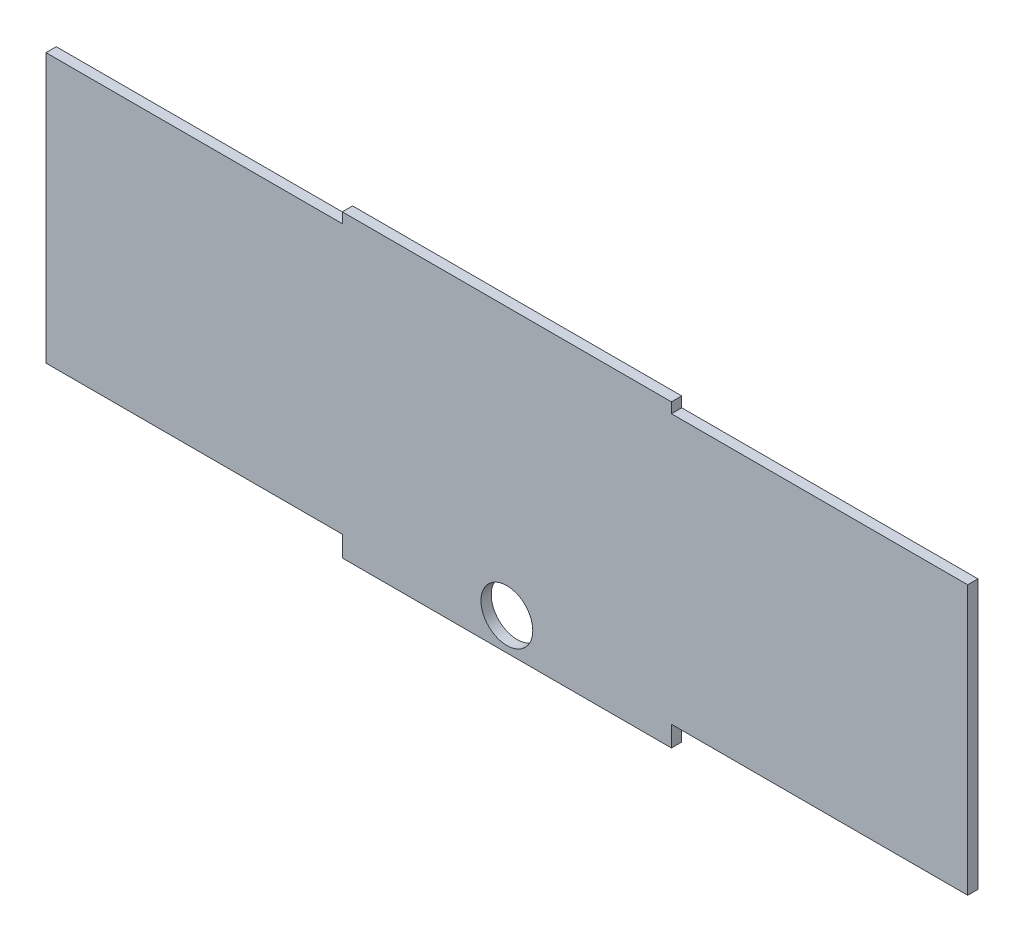
ISO-10303-21;
HEADER;
FILE_DESCRIPTION(('STEP AP214'),'2;1');
FILE_NAME('part.step','',(''),(''),'','','');
FILE_SCHEMA(('AUTOMOTIVE_DESIGN { 1 0 10303 214 1 1 1 1 }'));
ENDSEC;
DATA;
#1=APPLICATION_CONTEXT('core data for automotive mechanical design processes');
#2=APPLICATION_PROTOCOL_DEFINITION('international standard','automotive_design',2000,#1);
#3=PRODUCT_CONTEXT('',#1,'mechanical');
#4=PRODUCT('Part','Part','',(#3));
#5=PRODUCT_RELATED_PRODUCT_CATEGORY('part','',(#4));
#6=PRODUCT_DEFINITION_FORMATION('','',#4);
#7=PRODUCT_DEFINITION_CONTEXT('part definition',#1,'design');
#8=PRODUCT_DEFINITION('design','',#6,#7);
#9=PRODUCT_DEFINITION_SHAPE('','',#8);
#10=(LENGTH_UNIT() NAMED_UNIT(*) SI_UNIT(.MILLI.,.METRE.));
#11=(NAMED_UNIT(*) PLANE_ANGLE_UNIT() SI_UNIT($,.RADIAN.));
#12=(NAMED_UNIT(*) SI_UNIT($,.STERADIAN.) SOLID_ANGLE_UNIT());
#13=UNCERTAINTY_MEASURE_WITH_UNIT(LENGTH_MEASURE(1.E-05),#10,'distance_accuracy_value','');
#14=(GEOMETRIC_REPRESENTATION_CONTEXT(3) GLOBAL_UNCERTAINTY_ASSIGNED_CONTEXT((#13)) GLOBAL_UNIT_ASSIGNED_CONTEXT((#10,
#11,#12)) REPRESENTATION_CONTEXT('',''));
#15=CARTESIAN_POINT('',(0.,0.,0.));
#16=DIRECTION('',(0.,0.,1.));
#17=DIRECTION('',(1.,0.,0.));
#18=AXIS2_PLACEMENT_3D('',#15,#16,#17);
#19=CARTESIAN_POINT('',(0.,0.,0.79375));
#20=DIRECTION('',(0.,0.,1.));
#21=DIRECTION('',(1.,0.,0.));
#22=AXIS2_PLACEMENT_3D('',#19,#20,#21);
#23=PLANE('',#22);
#24=DIRECTION('',(0.,-1.,0.));
#25=VECTOR('',#24,1.);
#26=CARTESIAN_POINT('',(-71.12,20.75,0.79375));
#27=LINE('',#26,#25);
#28=CARTESIAN_POINT('',(-71.12,20.75,0.79375));
#29=VERTEX_POINT('',#28);
#30=CARTESIAN_POINT('',(-71.12,-20.75,0.79375));
#31=VERTEX_POINT('',#30);
#32=EDGE_CURVE('E178',#29,#31,#27,.T.);
#33=ORIENTED_EDGE('',*,*,#32,.T.);
#34=DIRECTION('',(1.,0.,0.));
#35=VECTOR('',#34,1.);
#36=CARTESIAN_POINT('',(-71.12,-20.75,0.79375));
#37=LINE('',#36,#35);
#38=CARTESIAN_POINT('',(-25.4,-20.75,0.79375));
#39=VERTEX_POINT('',#38);
#40=EDGE_CURVE('E106',#31,#39,#37,.T.);
#41=ORIENTED_EDGE('',*,*,#40,.T.);
#42=DIRECTION('',(0.,-1.,0.));
#43=VECTOR('',#42,1.);
#44=CARTESIAN_POINT('',(-25.4,-20.75,0.79375));
#45=LINE('',#44,#43);
#46=CARTESIAN_POINT('',(-25.4,-23.925,0.79375));
#47=VERTEX_POINT('',#46);
#48=EDGE_CURVE('E205',#39,#47,#45,.T.);
#49=ORIENTED_EDGE('',*,*,#48,.T.);
#50=DIRECTION('',(1.,0.,0.));
#51=VECTOR('',#50,1.);
#52=CARTESIAN_POINT('',(-25.4,-23.925,0.79375));
#53=LINE('',#52,#51);
#54=CARTESIAN_POINT('',(25.4,-23.925,0.79375));
#55=VERTEX_POINT('',#54);
#56=EDGE_CURVE('E224',#47,#55,#53,.T.);
#57=ORIENTED_EDGE('',*,*,#56,.T.);
#58=DIRECTION('',(0.,1.,0.));
#59=VECTOR('',#58,1.);
#60=CARTESIAN_POINT('',(25.4,-20.75,0.79375));
#61=LINE('',#60,#59);
#62=CARTESIAN_POINT('',(25.4,-20.75,0.79375));
#63=VERTEX_POINT('',#62);
#64=EDGE_CURVE('E221',#55,#63,#61,.T.);
#65=ORIENTED_EDGE('',*,*,#64,.T.);
#66=DIRECTION('',(1.,0.,0.));
#67=VECTOR('',#66,1.);
#68=CARTESIAN_POINT('',(25.4,-20.75,0.79375));
#69=LINE('',#68,#67);
#70=CARTESIAN_POINT('',(71.12,-20.75,0.79375));
#71=VERTEX_POINT('',#70);
#72=EDGE_CURVE('E223',#63,#71,#69,.T.);
#73=ORIENTED_EDGE('',*,*,#72,.T.);
#74=DIRECTION('',(0.,1.,0.));
#75=VECTOR('',#74,1.);
#76=CARTESIAN_POINT('',(71.12,20.75,0.79375));
#77=LINE('',#76,#75);
#78=CARTESIAN_POINT('',(71.12,20.75,0.79375));
#79=VERTEX_POINT('',#78);
#80=EDGE_CURVE('E226',#71,#79,#77,.T.);
#81=ORIENTED_EDGE('',*,*,#80,.T.);
#82=DIRECTION('',(-1.,0.,0.));
#83=VECTOR('',#82,1.);
#84=CARTESIAN_POINT('',(25.4,20.75,0.79375));
#85=LINE('',#84,#83);
#86=CARTESIAN_POINT('',(25.4,20.75,0.79375));
#87=VERTEX_POINT('',#86);
#88=EDGE_CURVE('E232',#79,#87,#85,.T.);
#89=ORIENTED_EDGE('',*,*,#88,.T.);
#90=DIRECTION('',(0.,1.,0.));
#91=VECTOR('',#90,1.);
#92=CARTESIAN_POINT('',(25.4,22.3375,0.79375));
#93=LINE('',#92,#91);
#94=CARTESIAN_POINT('',(25.4,22.3375,0.79375));
#95=VERTEX_POINT('',#94);
#96=EDGE_CURVE('E137',#87,#95,#93,.T.);
#97=ORIENTED_EDGE('',*,*,#96,.T.);
#98=DIRECTION('',(-1.,0.,0.));
#99=VECTOR('',#98,1.);
#100=CARTESIAN_POINT('',(-25.4,22.3375,0.79375));
#101=LINE('',#100,#99);
#102=CARTESIAN_POINT('',(-25.4,22.3375,0.79375));
#103=VERTEX_POINT('',#102);
#104=EDGE_CURVE('E131',#95,#103,#101,.T.);
#105=ORIENTED_EDGE('',*,*,#104,.T.);
#106=DIRECTION('',(0.,-1.,0.));
#107=VECTOR('',#106,1.);
#108=CARTESIAN_POINT('',(-25.4,22.3375,0.79375));
#109=LINE('',#108,#107);
#110=CARTESIAN_POINT('',(-25.4,20.75,0.79375));
#111=VERTEX_POINT('',#110);
#112=EDGE_CURVE('E135',#103,#111,#109,.T.);
#113=ORIENTED_EDGE('',*,*,#112,.T.);
#114=DIRECTION('',(-1.,0.,0.));
#115=VECTOR('',#114,1.);
#116=CARTESIAN_POINT('',(-71.12,20.75,0.79375));
#117=LINE('',#116,#115);
#118=EDGE_CURVE('E51',#111,#29,#117,.T.);
#119=ORIENTED_EDGE('',*,*,#118,.T.);
#120=EDGE_LOOP('',(#33,#41,#49,#57,#65,#73,#81,#89,#97,#105,#113,#119));
#121=FACE_BOUND('',#120,.T.);
#122=CARTESIAN_POINT('',(0.,-18.925,0.79375));
#123=DIRECTION('',(0.,0.,1.));
#124=DIRECTION('',(1.,0.,0.));
#125=AXIS2_PLACEMENT_3D('',#122,#123,#124);
#126=CIRCLE('',#125,4.);
#127=CARTESIAN_POINT('',(4.,-18.925,0.79375));
#128=VERTEX_POINT('',#127);
#129=EDGE_CURVE('E159',#128,#128,#126,.T.);
#130=ORIENTED_EDGE('',*,*,#129,.F.);
#131=EDGE_LOOP('',(#130));
#132=FACE_BOUND('',#131,.T.);
#133=ADVANCED_FACE('F34',(#121,#132),#23,.T.);
#134=CARTESIAN_POINT('',(0.,0.,-0.79375));
#135=DIRECTION('',(0.,0.,1.));
#136=DIRECTION('',(1.,0.,0.));
#137=AXIS2_PLACEMENT_3D('',#134,#135,#136);
#138=PLANE('',#137);
#139=DIRECTION('',(0.,-1.,0.));
#140=VECTOR('',#139,1.);
#141=CARTESIAN_POINT('',(-71.12,20.75,-0.79375));
#142=LINE('',#141,#140);
#143=CARTESIAN_POINT('',(-71.12,20.75,-0.79375));
#144=VERTEX_POINT('',#143);
#145=CARTESIAN_POINT('',(-71.12,-20.75,-0.79375));
#146=VERTEX_POINT('',#145);
#147=EDGE_CURVE('E155',#144,#146,#142,.T.);
#148=ORIENTED_EDGE('',*,*,#147,.F.);
#149=DIRECTION('',(-1.,0.,0.));
#150=VECTOR('',#149,1.);
#151=CARTESIAN_POINT('',(-71.12,20.75,-0.79375));
#152=LINE('',#151,#150);
#153=CARTESIAN_POINT('',(-25.4,20.75,-0.79375));
#154=VERTEX_POINT('',#153);
#155=EDGE_CURVE('E98',#154,#144,#152,.T.);
#156=ORIENTED_EDGE('',*,*,#155,.F.);
#157=DIRECTION('',(0.,-1.,0.));
#158=VECTOR('',#157,1.);
#159=CARTESIAN_POINT('',(-25.4,22.3375,-0.79375));
#160=LINE('',#159,#158);
#161=CARTESIAN_POINT('',(-25.4,22.3375,-0.79375));
#162=VERTEX_POINT('',#161);
#163=EDGE_CURVE('E92',#162,#154,#160,.T.);
#164=ORIENTED_EDGE('',*,*,#163,.F.);
#165=DIRECTION('',(-1.,0.,0.));
#166=VECTOR('',#165,1.);
#167=CARTESIAN_POINT('',(-25.4,22.3375,-0.79375));
#168=LINE('',#167,#166);
#169=CARTESIAN_POINT('',(25.4,22.3375,-0.79375));
#170=VERTEX_POINT('',#169);
#171=EDGE_CURVE('E145',#170,#162,#168,.T.);
#172=ORIENTED_EDGE('',*,*,#171,.F.);
#173=DIRECTION('',(0.,1.,0.));
#174=VECTOR('',#173,1.);
#175=CARTESIAN_POINT('',(25.4,22.3375,-0.79375));
#176=LINE('',#175,#174);
#177=CARTESIAN_POINT('',(25.4,20.75,-0.79375));
#178=VERTEX_POINT('',#177);
#179=EDGE_CURVE('E173',#178,#170,#176,.T.);
#180=ORIENTED_EDGE('',*,*,#179,.F.);
#181=DIRECTION('',(-1.,0.,0.));
#182=VECTOR('',#181,1.);
#183=CARTESIAN_POINT('',(25.4,20.75,-0.79375));
#184=LINE('',#183,#182);
#185=CARTESIAN_POINT('',(71.12,20.75,-0.79375));
#186=VERTEX_POINT('',#185);
#187=EDGE_CURVE('E171',#186,#178,#184,.T.);
#188=ORIENTED_EDGE('',*,*,#187,.F.);
#189=DIRECTION('',(0.,1.,0.));
#190=VECTOR('',#189,1.);
#191=CARTESIAN_POINT('',(71.12,20.75,-0.79375));
#192=LINE('',#191,#190);
#193=CARTESIAN_POINT('',(71.12,-20.75,-0.79375));
#194=VERTEX_POINT('',#193);
#195=EDGE_CURVE('E169',#194,#186,#192,.T.);
#196=ORIENTED_EDGE('',*,*,#195,.F.);
#197=DIRECTION('',(1.,0.,0.));
#198=VECTOR('',#197,1.);
#199=CARTESIAN_POINT('',(25.4,-20.75,-0.79375));
#200=LINE('',#199,#198);
#201=CARTESIAN_POINT('',(25.4,-20.75,-0.79375));
#202=VERTEX_POINT('',#201);
#203=EDGE_CURVE('E167',#202,#194,#200,.T.);
#204=ORIENTED_EDGE('',*,*,#203,.F.);
#205=DIRECTION('',(0.,1.,0.));
#206=VECTOR('',#205,1.);
#207=CARTESIAN_POINT('',(25.4,-20.75,-0.79375));
#208=LINE('',#207,#206);
#209=CARTESIAN_POINT('',(25.4,-23.925,-0.79375));
#210=VERTEX_POINT('',#209);
#211=EDGE_CURVE('E165',#210,#202,#208,.T.);
#212=ORIENTED_EDGE('',*,*,#211,.F.);
#213=DIRECTION('',(1.,0.,0.));
#214=VECTOR('',#213,1.);
#215=CARTESIAN_POINT('',(-25.4,-23.925,-0.79375));
#216=LINE('',#215,#214);
#217=CARTESIAN_POINT('',(-25.4,-23.925,-0.79375));
#218=VERTEX_POINT('',#217);
#219=EDGE_CURVE('E163',#218,#210,#216,.T.);
#220=ORIENTED_EDGE('',*,*,#219,.F.);
#221=DIRECTION('',(0.,-1.,0.));
#222=VECTOR('',#221,1.);
#223=CARTESIAN_POINT('',(-25.4,-20.75,-0.79375));
#224=LINE('',#223,#222);
#225=CARTESIAN_POINT('',(-25.4,-20.75,-0.79375));
#226=VERTEX_POINT('',#225);
#227=EDGE_CURVE('E161',#226,#218,#224,.T.);
#228=ORIENTED_EDGE('',*,*,#227,.F.);
#229=DIRECTION('',(1.,0.,0.));
#230=VECTOR('',#229,1.);
#231=CARTESIAN_POINT('',(-71.12,-20.75,-0.79375));
#232=LINE('',#231,#230);
#233=EDGE_CURVE('E158',#146,#226,#232,.T.);
#234=ORIENTED_EDGE('',*,*,#233,.F.);
#235=EDGE_LOOP('',(#148,#156,#164,#172,#180,#188,#196,#204,#212,#220,#228,#234));
#236=FACE_BOUND('',#235,.T.);
#237=CARTESIAN_POINT('',(0.,-18.925,-0.79375));
#238=DIRECTION('',(0.,0.,1.));
#239=DIRECTION('',(1.,0.,0.));
#240=AXIS2_PLACEMENT_3D('',#237,#238,#239);
#241=CIRCLE('',#240,4.);
#242=CARTESIAN_POINT('',(4.,-18.925,-0.79375));
#243=VERTEX_POINT('',#242);
#244=EDGE_CURVE('E379',#243,#243,#241,.T.);
#245=ORIENTED_EDGE('',*,*,#244,.T.);
#246=EDGE_LOOP('',(#245));
#247=FACE_BOUND('',#246,.T.);
#248=ADVANCED_FACE('F209',(#236,#247),#138,.F.);
#249=CARTESIAN_POINT('',(-71.12,20.75,0.79375));
#250=DIRECTION('',(1.,0.,0.));
#251=DIRECTION('',(0.,1.,0.));
#252=AXIS2_PLACEMENT_3D('',#249,#250,#251);
#253=PLANE('',#252);
#254=ORIENTED_EDGE('',*,*,#147,.T.);
#255=DIRECTION('',(0.,0.,-1.));
#256=VECTOR('',#255,1.);
#257=CARTESIAN_POINT('',(-71.12,-20.75,0.79375));
#258=LINE('',#257,#256);
#259=EDGE_CURVE('E11',#31,#146,#258,.T.);
#260=ORIENTED_EDGE('',*,*,#259,.F.);
#261=ORIENTED_EDGE('',*,*,#32,.F.);
#262=DIRECTION('',(0.,0.,-1.));
#263=VECTOR('',#262,1.);
#264=CARTESIAN_POINT('',(-71.12,20.75,0.79375));
#265=LINE('',#264,#263);
#266=EDGE_CURVE('E151',#29,#144,#265,.T.);
#267=ORIENTED_EDGE('',*,*,#266,.T.);
#268=EDGE_LOOP('',(#254,#260,#261,#267));
#269=FACE_BOUND('',#268,.T.);
#270=ADVANCED_FACE('F36',(#269),#253,.F.);
#271=CARTESIAN_POINT('',(-71.12,-20.75,0.79375));
#272=DIRECTION('',(0.,1.,0.));
#273=DIRECTION('',(0.,0.,1.));
#274=AXIS2_PLACEMENT_3D('',#271,#272,#273);
#275=PLANE('',#274);
#276=ORIENTED_EDGE('',*,*,#233,.T.);
#277=DIRECTION('',(0.,0.,-1.));
#278=VECTOR('',#277,1.);
#279=CARTESIAN_POINT('',(-25.4,-20.75,0.79375));
#280=LINE('',#279,#278);
#281=EDGE_CURVE('E43',#39,#226,#280,.T.);
#282=ORIENTED_EDGE('',*,*,#281,.F.);
#283=ORIENTED_EDGE('',*,*,#40,.F.);
#284=ORIENTED_EDGE('',*,*,#259,.T.);
#285=EDGE_LOOP('',(#276,#282,#283,#284));
#286=FACE_BOUND('',#285,.T.);
#287=ADVANCED_FACE('F266',(#286),#275,.F.);
#288=CARTESIAN_POINT('',(-25.4,-20.75,0.79375));
#289=DIRECTION('',(1.,0.,0.));
#290=DIRECTION('',(0.,0.,-1.));
#291=AXIS2_PLACEMENT_3D('',#288,#289,#290);
#292=PLANE('',#291);
#293=ORIENTED_EDGE('',*,*,#227,.T.);
#294=DIRECTION('',(0.,0.,-1.));
#295=VECTOR('',#294,1.);
#296=CARTESIAN_POINT('',(-25.4,-23.925,0.79375));
#297=LINE('',#296,#295);
#298=EDGE_CURVE('E197',#47,#218,#297,.T.);
#299=ORIENTED_EDGE('',*,*,#298,.F.);
#300=ORIENTED_EDGE('',*,*,#48,.F.);
#301=ORIENTED_EDGE('',*,*,#281,.T.);
#302=EDGE_LOOP('',(#293,#299,#300,#301));
#303=FACE_BOUND('',#302,.T.);
#304=ADVANCED_FACE('F203',(#303),#292,.F.);
#305=CARTESIAN_POINT('',(-25.4,-23.925,0.79375));
#306=DIRECTION('',(0.,1.,0.));
#307=DIRECTION('',(-1.,0.,0.));
#308=AXIS2_PLACEMENT_3D('',#305,#306,#307);
#309=PLANE('',#308);
#310=ORIENTED_EDGE('',*,*,#219,.T.);
#311=DIRECTION('',(0.,0.,-1.));
#312=VECTOR('',#311,1.);
#313=CARTESIAN_POINT('',(25.4,-23.925,0.79375));
#314=LINE('',#313,#312);
#315=EDGE_CURVE('E194',#55,#210,#314,.T.);
#316=ORIENTED_EDGE('',*,*,#315,.F.);
#317=ORIENTED_EDGE('',*,*,#56,.F.);
#318=ORIENTED_EDGE('',*,*,#298,.T.);
#319=EDGE_LOOP('',(#310,#316,#317,#318));
#320=FACE_BOUND('',#319,.T.);
#321=ADVANCED_FACE('F215',(#320),#309,.F.);
#322=CARTESIAN_POINT('',(25.4,-20.75,0.79375));
#323=DIRECTION('',(-1.,0.,0.));
#324=DIRECTION('',(0.,0.,1.));
#325=AXIS2_PLACEMENT_3D('',#322,#323,#324);
#326=PLANE('',#325);
#327=ORIENTED_EDGE('',*,*,#211,.T.);
#328=DIRECTION('',(0.,0.,-1.));
#329=VECTOR('',#328,1.);
#330=CARTESIAN_POINT('',(25.4,-20.75,0.79375));
#331=LINE('',#330,#329);
#332=EDGE_CURVE('E191',#63,#202,#331,.T.);
#333=ORIENTED_EDGE('',*,*,#332,.F.);
#334=ORIENTED_EDGE('',*,*,#64,.F.);
#335=ORIENTED_EDGE('',*,*,#315,.T.);
#336=EDGE_LOOP('',(#327,#333,#334,#335));
#337=FACE_BOUND('',#336,.T.);
#338=ADVANCED_FACE('F219',(#337),#326,.F.);
#339=CARTESIAN_POINT('',(25.4,-20.75,0.79375));
#340=DIRECTION('',(0.,1.,0.));
#341=DIRECTION('',(-1.,0.,0.));
#342=AXIS2_PLACEMENT_3D('',#339,#340,#341);
#343=PLANE('',#342);
#344=ORIENTED_EDGE('',*,*,#203,.T.);
#345=DIRECTION('',(0.,0.,-1.));
#346=VECTOR('',#345,1.);
#347=CARTESIAN_POINT('',(71.12,-20.75,0.79375));
#348=LINE('',#347,#346);
#349=EDGE_CURVE('E188',#71,#194,#348,.T.);
#350=ORIENTED_EDGE('',*,*,#349,.F.);
#351=ORIENTED_EDGE('',*,*,#72,.F.);
#352=ORIENTED_EDGE('',*,*,#332,.T.);
#353=EDGE_LOOP('',(#344,#350,#351,#352));
#354=FACE_BOUND('',#353,.T.);
#355=ADVANCED_FACE('F279',(#354),#343,.F.);
#356=CARTESIAN_POINT('',(71.12,20.75,0.79375));
#357=DIRECTION('',(-1.,0.,0.));
#358=DIRECTION('',(0.,0.,1.));
#359=AXIS2_PLACEMENT_3D('',#356,#357,#358);
#360=PLANE('',#359);
#361=ORIENTED_EDGE('',*,*,#195,.T.);
#362=DIRECTION('',(0.,0.,-1.));
#363=VECTOR('',#362,1.);
#364=CARTESIAN_POINT('',(71.12,20.75,0.79375));
#365=LINE('',#364,#363);
#366=EDGE_CURVE('E185',#79,#186,#365,.T.);
#367=ORIENTED_EDGE('',*,*,#366,.F.);
#368=ORIENTED_EDGE('',*,*,#80,.F.);
#369=ORIENTED_EDGE('',*,*,#349,.T.);
#370=EDGE_LOOP('',(#361,#367,#368,#369));
#371=FACE_BOUND('',#370,.T.);
#372=ADVANCED_FACE('F282',(#371),#360,.F.);
#373=CARTESIAN_POINT('',(25.4,20.75,0.79375));
#374=DIRECTION('',(0.,-1.,0.));
#375=DIRECTION('',(1.,0.,0.));
#376=AXIS2_PLACEMENT_3D('',#373,#374,#375);
#377=PLANE('',#376);
#378=ORIENTED_EDGE('',*,*,#187,.T.);
#379=DIRECTION('',(0.,0.,-1.));
#380=VECTOR('',#379,1.);
#381=CARTESIAN_POINT('',(25.4,20.75,0.79375));
#382=LINE('',#381,#380);
#383=EDGE_CURVE('E182',#87,#178,#382,.T.);
#384=ORIENTED_EDGE('',*,*,#383,.F.);
#385=ORIENTED_EDGE('',*,*,#88,.F.);
#386=ORIENTED_EDGE('',*,*,#366,.T.);
#387=EDGE_LOOP('',(#378,#384,#385,#386));
#388=FACE_BOUND('',#387,.T.);
#389=ADVANCED_FACE('F238',(#388),#377,.F.);
#390=CARTESIAN_POINT('',(25.4,22.3375,0.79375));
#391=DIRECTION('',(-1.,0.,0.));
#392=DIRECTION('',(0.,-1.,0.));
#393=AXIS2_PLACEMENT_3D('',#390,#391,#392);
#394=PLANE('',#393);
#395=ORIENTED_EDGE('',*,*,#179,.T.);
#396=DIRECTION('',(0.,0.,-1.));
#397=VECTOR('',#396,1.);
#398=CARTESIAN_POINT('',(25.4,22.3375,0.79375));
#399=LINE('',#398,#397);
#400=EDGE_CURVE('E146',#95,#170,#399,.T.);
#401=ORIENTED_EDGE('',*,*,#400,.F.);
#402=ORIENTED_EDGE('',*,*,#96,.F.);
#403=ORIENTED_EDGE('',*,*,#383,.T.);
#404=EDGE_LOOP('',(#395,#401,#402,#403));
#405=FACE_BOUND('',#404,.T.);
#406=ADVANCED_FACE('F242',(#405),#394,.F.);
#407=CARTESIAN_POINT('',(-25.4,22.3375,0.79375));
#408=DIRECTION('',(0.,-1.,0.));
#409=DIRECTION('',(1.,0.,0.));
#410=AXIS2_PLACEMENT_3D('',#407,#408,#409);
#411=PLANE('',#410);
#412=ORIENTED_EDGE('',*,*,#171,.T.);
#413=DIRECTION('',(0.,0.,-1.));
#414=VECTOR('',#413,1.);
#415=CARTESIAN_POINT('',(-25.4,22.3375,0.79375));
#416=LINE('',#415,#414);
#417=EDGE_CURVE('E142',#103,#162,#416,.T.);
#418=ORIENTED_EDGE('',*,*,#417,.F.);
#419=ORIENTED_EDGE('',*,*,#104,.F.);
#420=ORIENTED_EDGE('',*,*,#400,.T.);
#421=EDGE_LOOP('',(#412,#418,#419,#420));
#422=FACE_BOUND('',#421,.T.);
#423=ADVANCED_FACE('F143',(#422),#411,.F.);
#424=CARTESIAN_POINT('',(-25.4,22.3375,0.79375));
#425=DIRECTION('',(1.,0.,0.));
#426=DIRECTION('',(0.,1.,0.));
#427=AXIS2_PLACEMENT_3D('',#424,#425,#426);
#428=PLANE('',#427);
#429=ORIENTED_EDGE('',*,*,#163,.T.);
#430=DIRECTION('',(0.,0.,-1.));
#431=VECTOR('',#430,1.);
#432=CARTESIAN_POINT('',(-25.4,20.75,0.79375));
#433=LINE('',#432,#431);
#434=EDGE_CURVE('E147',#111,#154,#433,.T.);
#435=ORIENTED_EDGE('',*,*,#434,.F.);
#436=ORIENTED_EDGE('',*,*,#112,.F.);
#437=ORIENTED_EDGE('',*,*,#417,.T.);
#438=EDGE_LOOP('',(#429,#435,#436,#437));
#439=FACE_BOUND('',#438,.T.);
#440=ADVANCED_FACE('F149',(#439),#428,.F.);
#441=CARTESIAN_POINT('',(-71.12,20.75,0.79375));
#442=DIRECTION('',(0.,-1.,0.));
#443=DIRECTION('',(0.,0.,-1.));
#444=AXIS2_PLACEMENT_3D('',#441,#442,#443);
#445=PLANE('',#444);
#446=ORIENTED_EDGE('',*,*,#155,.T.);
#447=ORIENTED_EDGE('',*,*,#266,.F.);
#448=ORIENTED_EDGE('',*,*,#118,.F.);
#449=ORIENTED_EDGE('',*,*,#434,.T.);
#450=EDGE_LOOP('',(#446,#447,#448,#449));
#451=FACE_BOUND('',#450,.T.);
#452=ADVANCED_FACE('F246',(#451),#445,.F.);
#453=CARTESIAN_POINT('',(0.,-18.925,0.79375));
#454=DIRECTION('',(0.,0.,-1.));
#455=DIRECTION('',(-1.,0.,0.));
#456=AXIS2_PLACEMENT_3D('',#453,#454,#455);
#457=CYLINDRICAL_SURFACE('',#456,4.);
#458=ORIENTED_EDGE('',*,*,#129,.T.);
#459=EDGE_LOOP('',(#458));
#460=FACE_BOUND('',#459,.T.);
#461=ORIENTED_EDGE('',*,*,#244,.F.);
#462=EDGE_LOOP('',(#461));
#463=FACE_BOUND('',#462,.T.);
#464=ADVANCED_FACE('F248',(#460,#463),#457,.F.);
#465=CLOSED_SHELL('',(#133,#248,#270,#287,#304,#321,#338,#355,#372,#389,#406,#423,#440,#452,#464));
#466=MANIFOLD_SOLID_BREP('B2',#465);
#467=ADVANCED_BREP_SHAPE_REPRESENTATION('',(#18,#466),#14);
#468=SHAPE_DEFINITION_REPRESENTATION(#9,#467);
ENDSEC;
END-ISO-10303-21;
